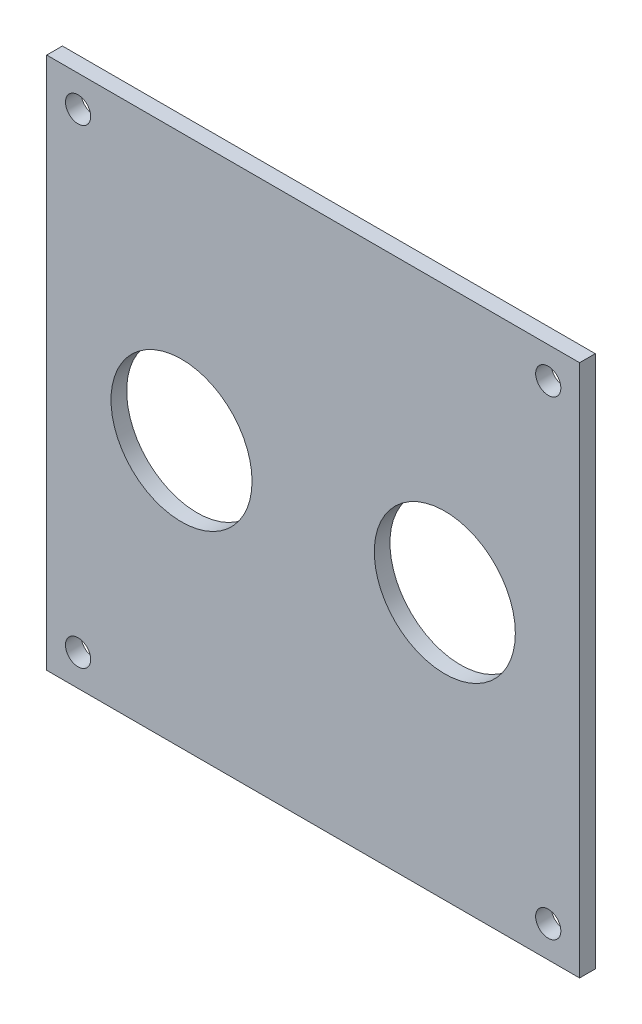
ISO-10303-21;
HEADER;
FILE_DESCRIPTION(('STEP AP214'),'2;1');
FILE_NAME('part.step','',(''),(''),'','','');
FILE_SCHEMA(('AUTOMOTIVE_DESIGN { 1 0 10303 214 1 1 1 1 }'));
ENDSEC;
DATA;
#1=APPLICATION_CONTEXT('core data for automotive mechanical design processes');
#2=APPLICATION_PROTOCOL_DEFINITION('international standard','automotive_design',2000,#1);
#3=PRODUCT_CONTEXT('',#1,'mechanical');
#4=PRODUCT('Part','Part','',(#3));
#5=PRODUCT_RELATED_PRODUCT_CATEGORY('part','',(#4));
#6=PRODUCT_DEFINITION_FORMATION('','',#4);
#7=PRODUCT_DEFINITION_CONTEXT('part definition',#1,'design');
#8=PRODUCT_DEFINITION('design','',#6,#7);
#9=PRODUCT_DEFINITION_SHAPE('','',#8);
#10=(LENGTH_UNIT() NAMED_UNIT(*) SI_UNIT(.MILLI.,.METRE.));
#11=(NAMED_UNIT(*) PLANE_ANGLE_UNIT() SI_UNIT($,.RADIAN.));
#12=(NAMED_UNIT(*) SI_UNIT($,.STERADIAN.) SOLID_ANGLE_UNIT());
#13=UNCERTAINTY_MEASURE_WITH_UNIT(LENGTH_MEASURE(1.E-05),#10,'distance_accuracy_value','');
#14=(GEOMETRIC_REPRESENTATION_CONTEXT(3) GLOBAL_UNCERTAINTY_ASSIGNED_CONTEXT((#13)) GLOBAL_UNIT_ASSIGNED_CONTEXT((#10,
#11,#12)) REPRESENTATION_CONTEXT('',''));
#15=CARTESIAN_POINT('',(0.,0.,0.));
#16=DIRECTION('',(0.,0.,1.));
#17=DIRECTION('',(1.,0.,0.));
#18=AXIS2_PLACEMENT_3D('',#15,#16,#17);
#19=CARTESIAN_POINT('',(0.,0.,3.175));
#20=DIRECTION('',(1.,0.,0.));
#21=DIRECTION('',(0.,0.,-1.));
#22=AXIS2_PLACEMENT_3D('',#19,#20,#21);
#23=PLANE('',#22);
#24=DIRECTION('',(0.,-1.,0.));
#25=VECTOR('',#24,1.);
#26=CARTESIAN_POINT('',(0.,0.,0.));
#27=LINE('',#26,#25);
#28=CARTESIAN_POINT('',(0.,107.95,0.));
#29=VERTEX_POINT('',#28);
#30=CARTESIAN_POINT('',(0.,0.,0.));
#31=VERTEX_POINT('',#30);
#32=EDGE_CURVE('E96',#29,#31,#27,.T.);
#33=ORIENTED_EDGE('',*,*,#32,.T.);
#34=DIRECTION('',(0.,0.,-1.));
#35=VECTOR('',#34,1.);
#36=CARTESIAN_POINT('',(0.,0.,3.175));
#37=LINE('',#36,#35);
#38=CARTESIAN_POINT('',(0.,0.,3.175));
#39=VERTEX_POINT('',#38);
#40=EDGE_CURVE('E11',#39,#31,#37,.T.);
#41=ORIENTED_EDGE('',*,*,#40,.F.);
#42=DIRECTION('',(0.,-1.,0.));
#43=VECTOR('',#42,1.);
#44=CARTESIAN_POINT('',(0.,0.,3.175));
#45=LINE('',#44,#43);
#46=CARTESIAN_POINT('',(0.,107.95,3.175));
#47=VERTEX_POINT('',#46);
#48=EDGE_CURVE('E84',#47,#39,#45,.T.);
#49=ORIENTED_EDGE('',*,*,#48,.F.);
#50=DIRECTION('',(0.,0.,-1.));
#51=VECTOR('',#50,1.);
#52=CARTESIAN_POINT('',(0.,107.95,3.175));
#53=LINE('',#52,#51);
#54=EDGE_CURVE('E92',#47,#29,#53,.T.);
#55=ORIENTED_EDGE('',*,*,#54,.T.);
#56=EDGE_LOOP('',(#33,#41,#49,#55));
#57=FACE_BOUND('',#56,.T.);
#58=ADVANCED_FACE('F33',(#57),#23,.F.);
#59=CARTESIAN_POINT('',(0.,0.,3.175));
#60=DIRECTION('',(0.,1.,0.));
#61=DIRECTION('',(0.,0.,1.));
#62=AXIS2_PLACEMENT_3D('',#59,#60,#61);
#63=PLANE('',#62);
#64=DIRECTION('',(1.,0.,0.));
#65=VECTOR('',#64,1.);
#66=CARTESIAN_POINT('',(0.,0.,0.));
#67=LINE('',#66,#65);
#68=CARTESIAN_POINT('',(107.95,0.,0.));
#69=VERTEX_POINT('',#68);
#70=EDGE_CURVE('E88',#31,#69,#67,.T.);
#71=ORIENTED_EDGE('',*,*,#70,.T.);
#72=DIRECTION('',(0.,0.,-1.));
#73=VECTOR('',#72,1.);
#74=CARTESIAN_POINT('',(107.95,0.,3.175));
#75=LINE('',#74,#73);
#76=CARTESIAN_POINT('',(107.95,0.,3.175));
#77=VERTEX_POINT('',#76);
#78=EDGE_CURVE('E41',#77,#69,#75,.T.);
#79=ORIENTED_EDGE('',*,*,#78,.F.);
#80=DIRECTION('',(1.,0.,0.));
#81=VECTOR('',#80,1.);
#82=CARTESIAN_POINT('',(0.,0.,3.175));
#83=LINE('',#82,#81);
#84=EDGE_CURVE('E79',#39,#77,#83,.T.);
#85=ORIENTED_EDGE('',*,*,#84,.F.);
#86=ORIENTED_EDGE('',*,*,#40,.T.);
#87=EDGE_LOOP('',(#71,#79,#85,#86));
#88=FACE_BOUND('',#87,.T.);
#89=ADVANCED_FACE('F87',(#88),#63,.F.);
#90=CARTESIAN_POINT('',(107.95,0.,3.175));
#91=DIRECTION('',(-1.,0.,0.));
#92=DIRECTION('',(0.,0.,1.));
#93=AXIS2_PLACEMENT_3D('',#90,#91,#92);
#94=PLANE('',#93);
#95=DIRECTION('',(0.,1.,0.));
#96=VECTOR('',#95,1.);
#97=CARTESIAN_POINT('',(107.95,0.,0.));
#98=LINE('',#97,#96);
#99=CARTESIAN_POINT('',(107.95,107.95,0.));
#100=VERTEX_POINT('',#99);
#101=EDGE_CURVE('E66',#69,#100,#98,.T.);
#102=ORIENTED_EDGE('',*,*,#101,.T.);
#103=DIRECTION('',(0.,0.,-1.));
#104=VECTOR('',#103,1.);
#105=CARTESIAN_POINT('',(107.95,107.95,3.175));
#106=LINE('',#105,#104);
#107=CARTESIAN_POINT('',(107.95,107.95,3.175));
#108=VERTEX_POINT('',#107);
#109=EDGE_CURVE('E89',#108,#100,#106,.T.);
#110=ORIENTED_EDGE('',*,*,#109,.F.);
#111=DIRECTION('',(0.,1.,0.));
#112=VECTOR('',#111,1.);
#113=CARTESIAN_POINT('',(107.95,0.,3.175));
#114=LINE('',#113,#112);
#115=EDGE_CURVE('E82',#77,#108,#114,.T.);
#116=ORIENTED_EDGE('',*,*,#115,.F.);
#117=ORIENTED_EDGE('',*,*,#78,.T.);
#118=EDGE_LOOP('',(#102,#110,#116,#117));
#119=FACE_BOUND('',#118,.T.);
#120=ADVANCED_FACE('F90',(#119),#94,.F.);
#121=CARTESIAN_POINT('',(0.,107.95,3.175));
#122=DIRECTION('',(0.,-1.,0.));
#123=DIRECTION('',(0.,0.,-1.));
#124=AXIS2_PLACEMENT_3D('',#121,#122,#123);
#125=PLANE('',#124);
#126=DIRECTION('',(-1.,0.,0.));
#127=VECTOR('',#126,1.);
#128=CARTESIAN_POINT('',(0.,107.95,0.));
#129=LINE('',#128,#127);
#130=EDGE_CURVE('E72',#100,#29,#129,.T.);
#131=ORIENTED_EDGE('',*,*,#130,.T.);
#132=ORIENTED_EDGE('',*,*,#54,.F.);
#133=DIRECTION('',(-1.,0.,0.));
#134=VECTOR('',#133,1.);
#135=CARTESIAN_POINT('',(0.,107.95,3.175));
#136=LINE('',#135,#134);
#137=EDGE_CURVE('E49',#108,#47,#136,.T.);
#138=ORIENTED_EDGE('',*,*,#137,.F.);
#139=ORIENTED_EDGE('',*,*,#109,.T.);
#140=EDGE_LOOP('',(#131,#132,#138,#139));
#141=FACE_BOUND('',#140,.T.);
#142=ADVANCED_FACE('F104',(#141),#125,.F.);
#143=CARTESIAN_POINT('',(0.,0.,3.175));
#144=DIRECTION('',(0.,0.,-1.));
#145=DIRECTION('',(-1.,0.,0.));
#146=AXIS2_PLACEMENT_3D('',#143,#144,#145);
#147=PLANE('',#146);
#148=CARTESIAN_POINT('',(80.645,53.975,3.175));
#149=DIRECTION('',(0.,0.,1.));
#150=DIRECTION('',(1.,0.,0.));
#151=AXIS2_PLACEMENT_3D('',#148,#149,#150);
#152=CIRCLE('',#151,14.2875);
#153=CARTESIAN_POINT('',(94.9325,53.975,3.175));
#154=VERTEX_POINT('',#153);
#155=EDGE_CURVE('E140',#154,#154,#152,.T.);
#156=ORIENTED_EDGE('',*,*,#155,.F.);
#157=EDGE_LOOP('',(#156));
#158=FACE_BOUND('',#157,.T.);
#159=CARTESIAN_POINT('',(27.305,53.975,3.175));
#160=DIRECTION('',(0.,0.,1.));
#161=DIRECTION('',(1.,0.,0.));
#162=AXIS2_PLACEMENT_3D('',#159,#160,#161);
#163=CIRCLE('',#162,14.2875);
#164=CARTESIAN_POINT('',(41.5925,53.975,3.175));
#165=VERTEX_POINT('',#164);
#166=EDGE_CURVE('E134',#165,#165,#163,.T.);
#167=ORIENTED_EDGE('',*,*,#166,.F.);
#168=EDGE_LOOP('',(#167));
#169=FACE_BOUND('',#168,.T.);
#170=CARTESIAN_POINT('',(6.35,6.34999999999999,3.175));
#171=DIRECTION('',(0.,0.,-1.));
#172=DIRECTION('',(-1.,0.,0.));
#173=AXIS2_PLACEMENT_3D('',#170,#171,#172);
#174=CIRCLE('',#173,2.5527);
#175=CARTESIAN_POINT('',(3.7973,6.34999999999999,3.175));
#176=VERTEX_POINT('',#175);
#177=EDGE_CURVE('E125',#176,#176,#174,.T.);
#178=ORIENTED_EDGE('',*,*,#177,.T.);
#179=EDGE_LOOP('',(#178));
#180=FACE_BOUND('',#179,.T.);
#181=CARTESIAN_POINT('',(101.6,6.35,3.175));
#182=DIRECTION('',(0.,0.,-1.));
#183=DIRECTION('',(-1.,0.,0.));
#184=AXIS2_PLACEMENT_3D('',#181,#182,#183);
#185=CIRCLE('',#184,2.55270000000001);
#186=CARTESIAN_POINT('',(99.0473,6.35,3.175));
#187=VERTEX_POINT('',#186);
#188=EDGE_CURVE('E119',#187,#187,#185,.T.);
#189=ORIENTED_EDGE('',*,*,#188,.T.);
#190=EDGE_LOOP('',(#189));
#191=FACE_BOUND('',#190,.T.);
#192=CARTESIAN_POINT('',(101.6,101.6,3.175));
#193=DIRECTION('',(0.,0.,-1.));
#194=DIRECTION('',(-1.,0.,0.));
#195=AXIS2_PLACEMENT_3D('',#192,#193,#194);
#196=CIRCLE('',#195,2.55270000000003);
#197=CARTESIAN_POINT('',(99.0473,101.6,3.175));
#198=VERTEX_POINT('',#197);
#199=EDGE_CURVE('E113',#198,#198,#196,.T.);
#200=ORIENTED_EDGE('',*,*,#199,.T.);
#201=EDGE_LOOP('',(#200));
#202=FACE_BOUND('',#201,.T.);
#203=CARTESIAN_POINT('',(6.35,101.6,3.175));
#204=DIRECTION('',(0.,0.,-1.));
#205=DIRECTION('',(-1.,0.,0.));
#206=AXIS2_PLACEMENT_3D('',#203,#204,#205);
#207=CIRCLE('',#206,2.5527);
#208=CARTESIAN_POINT('',(3.7973,101.6,3.175));
#209=VERTEX_POINT('',#208);
#210=EDGE_CURVE('E99',#209,#209,#207,.T.);
#211=ORIENTED_EDGE('',*,*,#210,.T.);
#212=EDGE_LOOP('',(#211));
#213=FACE_BOUND('',#212,.T.);
#214=ORIENTED_EDGE('',*,*,#48,.T.);
#215=ORIENTED_EDGE('',*,*,#84,.T.);
#216=ORIENTED_EDGE('',*,*,#115,.T.);
#217=ORIENTED_EDGE('',*,*,#137,.T.);
#218=EDGE_LOOP('',(#214,#215,#216,#217));
#219=FACE_BOUND('',#218,.T.);
#220=ADVANCED_FACE('F80',(#158,#169,#180,#191,#202,#213,#219),#147,.F.);
#221=CARTESIAN_POINT('',(0.,0.,0.));
#222=DIRECTION('',(0.,0.,-1.));
#223=DIRECTION('',(-1.,0.,0.));
#224=AXIS2_PLACEMENT_3D('',#221,#222,#223);
#225=PLANE('',#224);
#226=CARTESIAN_POINT('',(80.645,53.975,0.));
#227=DIRECTION('',(0.,0.,1.));
#228=DIRECTION('',(1.,0.,0.));
#229=AXIS2_PLACEMENT_3D('',#226,#227,#228);
#230=CIRCLE('',#229,14.2875);
#231=CARTESIAN_POINT('',(94.9325,53.975,0.));
#232=VERTEX_POINT('',#231);
#233=EDGE_CURVE('E137',#232,#232,#230,.T.);
#234=ORIENTED_EDGE('',*,*,#233,.T.);
#235=EDGE_LOOP('',(#234));
#236=FACE_BOUND('',#235,.T.);
#237=CARTESIAN_POINT('',(27.305,53.975,0.));
#238=DIRECTION('',(0.,0.,1.));
#239=DIRECTION('',(1.,0.,0.));
#240=AXIS2_PLACEMENT_3D('',#237,#238,#239);
#241=CIRCLE('',#240,14.2875);
#242=CARTESIAN_POINT('',(41.5925,53.975,0.));
#243=VERTEX_POINT('',#242);
#244=EDGE_CURVE('E131',#243,#243,#241,.T.);
#245=ORIENTED_EDGE('',*,*,#244,.T.);
#246=EDGE_LOOP('',(#245));
#247=FACE_BOUND('',#246,.T.);
#248=CARTESIAN_POINT('',(6.35,6.34999999999999,0.));
#249=DIRECTION('',(0.,0.,-1.));
#250=DIRECTION('',(-1.,0.,0.));
#251=AXIS2_PLACEMENT_3D('',#248,#249,#250);
#252=CIRCLE('',#251,2.5527);
#253=CARTESIAN_POINT('',(3.7973,6.34999999999999,0.));
#254=VERTEX_POINT('',#253);
#255=EDGE_CURVE('E128',#254,#254,#252,.T.);
#256=ORIENTED_EDGE('',*,*,#255,.F.);
#257=EDGE_LOOP('',(#256));
#258=FACE_BOUND('',#257,.T.);
#259=CARTESIAN_POINT('',(101.6,6.35,0.));
#260=DIRECTION('',(0.,0.,-1.));
#261=DIRECTION('',(-1.,0.,0.));
#262=AXIS2_PLACEMENT_3D('',#259,#260,#261);
#263=CIRCLE('',#262,2.55270000000001);
#264=CARTESIAN_POINT('',(99.0473,6.35,0.));
#265=VERTEX_POINT('',#264);
#266=EDGE_CURVE('E122',#265,#265,#263,.T.);
#267=ORIENTED_EDGE('',*,*,#266,.F.);
#268=EDGE_LOOP('',(#267));
#269=FACE_BOUND('',#268,.T.);
#270=CARTESIAN_POINT('',(101.6,101.6,0.));
#271=DIRECTION('',(0.,0.,-1.));
#272=DIRECTION('',(-1.,0.,0.));
#273=AXIS2_PLACEMENT_3D('',#270,#271,#272);
#274=CIRCLE('',#273,2.55270000000003);
#275=CARTESIAN_POINT('',(99.0473,101.6,0.));
#276=VERTEX_POINT('',#275);
#277=EDGE_CURVE('E116',#276,#276,#274,.T.);
#278=ORIENTED_EDGE('',*,*,#277,.F.);
#279=EDGE_LOOP('',(#278));
#280=FACE_BOUND('',#279,.T.);
#281=CARTESIAN_POINT('',(6.35,101.6,0.));
#282=DIRECTION('',(0.,0.,-1.));
#283=DIRECTION('',(-1.,0.,0.));
#284=AXIS2_PLACEMENT_3D('',#281,#282,#283);
#285=CIRCLE('',#284,2.5527);
#286=CARTESIAN_POINT('',(3.7973,101.6,0.));
#287=VERTEX_POINT('',#286);
#288=EDGE_CURVE('E110',#287,#287,#285,.T.);
#289=ORIENTED_EDGE('',*,*,#288,.F.);
#290=EDGE_LOOP('',(#289));
#291=FACE_BOUND('',#290,.T.);
#292=ORIENTED_EDGE('',*,*,#32,.F.);
#293=ORIENTED_EDGE('',*,*,#130,.F.);
#294=ORIENTED_EDGE('',*,*,#101,.F.);
#295=ORIENTED_EDGE('',*,*,#70,.F.);
#296=EDGE_LOOP('',(#292,#293,#294,#295));
#297=FACE_BOUND('',#296,.T.);
#298=ADVANCED_FACE('F107',(#236,#247,#258,#269,#280,#291,#297),#225,.T.);
#299=CARTESIAN_POINT('',(6.35,101.6,3.175));
#300=DIRECTION('',(0.,0.,-1.));
#301=DIRECTION('',(-1.,0.,0.));
#302=AXIS2_PLACEMENT_3D('',#299,#300,#301);
#303=CYLINDRICAL_SURFACE('',#302,2.5527);
#304=ORIENTED_EDGE('',*,*,#210,.F.);
#305=EDGE_LOOP('',(#304));
#306=FACE_BOUND('',#305,.T.);
#307=ORIENTED_EDGE('',*,*,#288,.T.);
#308=EDGE_LOOP('',(#307));
#309=FACE_BOUND('',#308,.T.);
#310=ADVANCED_FACE('F168',(#306,#309),#303,.F.);
#311=CARTESIAN_POINT('',(101.6,101.6,3.175));
#312=DIRECTION('',(0.,0.,-1.));
#313=DIRECTION('',(-1.,0.,0.));
#314=AXIS2_PLACEMENT_3D('',#311,#312,#313);
#315=CYLINDRICAL_SURFACE('',#314,2.55270000000003);
#316=ORIENTED_EDGE('',*,*,#199,.F.);
#317=EDGE_LOOP('',(#316));
#318=FACE_BOUND('',#317,.T.);
#319=ORIENTED_EDGE('',*,*,#277,.T.);
#320=EDGE_LOOP('',(#319));
#321=FACE_BOUND('',#320,.T.);
#322=ADVANCED_FACE('F171',(#318,#321),#315,.F.);
#323=CARTESIAN_POINT('',(101.6,6.35,3.175));
#324=DIRECTION('',(0.,0.,-1.));
#325=DIRECTION('',(-1.,0.,0.));
#326=AXIS2_PLACEMENT_3D('',#323,#324,#325);
#327=CYLINDRICAL_SURFACE('',#326,2.55270000000001);
#328=ORIENTED_EDGE('',*,*,#188,.F.);
#329=EDGE_LOOP('',(#328));
#330=FACE_BOUND('',#329,.T.);
#331=ORIENTED_EDGE('',*,*,#266,.T.);
#332=EDGE_LOOP('',(#331));
#333=FACE_BOUND('',#332,.T.);
#334=ADVANCED_FACE('F215',(#330,#333),#327,.F.);
#335=CARTESIAN_POINT('',(6.35,6.34999999999999,3.175));
#336=DIRECTION('',(0.,0.,-1.));
#337=DIRECTION('',(-1.,0.,0.));
#338=AXIS2_PLACEMENT_3D('',#335,#336,#337);
#339=CYLINDRICAL_SURFACE('',#338,2.5527);
#340=ORIENTED_EDGE('',*,*,#177,.F.);
#341=EDGE_LOOP('',(#340));
#342=FACE_BOUND('',#341,.T.);
#343=ORIENTED_EDGE('',*,*,#255,.T.);
#344=EDGE_LOOP('',(#343));
#345=FACE_BOUND('',#344,.T.);
#346=ADVANCED_FACE('F223',(#342,#345),#339,.F.);
#347=CARTESIAN_POINT('',(27.305,53.975,0.));
#348=DIRECTION('',(0.,0.,1.));
#349=DIRECTION('',(1.,0.,0.));
#350=AXIS2_PLACEMENT_3D('',#347,#348,#349);
#351=CYLINDRICAL_SURFACE('',#350,14.2875);
#352=ORIENTED_EDGE('',*,*,#244,.F.);
#353=EDGE_LOOP('',(#352));
#354=FACE_BOUND('',#353,.T.);
#355=ORIENTED_EDGE('',*,*,#166,.T.);
#356=EDGE_LOOP('',(#355));
#357=FACE_BOUND('',#356,.T.);
#358=ADVANCED_FACE('F151',(#354,#357),#351,.F.);
#359=CARTESIAN_POINT('',(80.645,53.975,0.));
#360=DIRECTION('',(0.,0.,1.));
#361=DIRECTION('',(1.,0.,0.));
#362=AXIS2_PLACEMENT_3D('',#359,#360,#361);
#363=CYLINDRICAL_SURFACE('',#362,14.2875);
#364=ORIENTED_EDGE('',*,*,#233,.F.);
#365=EDGE_LOOP('',(#364));
#366=FACE_BOUND('',#365,.T.);
#367=ORIENTED_EDGE('',*,*,#155,.T.);
#368=EDGE_LOOP('',(#367));
#369=FACE_BOUND('',#368,.T.);
#370=ADVANCED_FACE('F148',(#366,#369),#363,.F.);
#371=CLOSED_SHELL('',(#58,#89,#120,#142,#220,#298,#310,#322,#334,#346,#358,#370));
#372=MANIFOLD_SOLID_BREP('B2',#371);
#373=ADVANCED_BREP_SHAPE_REPRESENTATION('',(#18,#372),#14);
#374=SHAPE_DEFINITION_REPRESENTATION(#9,#373);
ENDSEC;
END-ISO-10303-21;
